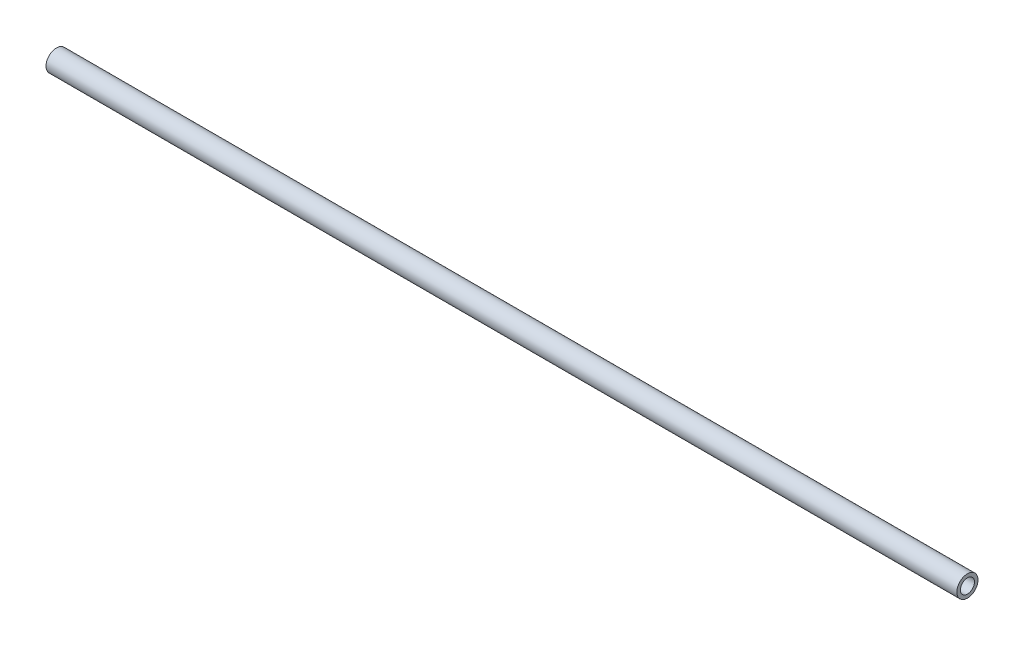
ISO-10303-21;
HEADER;
FILE_DESCRIPTION(('STEP AP214'),'2;1');
FILE_NAME('part.step','',(''),(''),'','','');
FILE_SCHEMA(('AUTOMOTIVE_DESIGN { 1 0 10303 214 1 1 1 1 }'));
ENDSEC;
DATA;
#1=APPLICATION_CONTEXT('core data for automotive mechanical design processes');
#2=APPLICATION_PROTOCOL_DEFINITION('international standard','automotive_design',2000,#1);
#3=PRODUCT_CONTEXT('',#1,'mechanical');
#4=PRODUCT('Part','Part','',(#3));
#5=PRODUCT_RELATED_PRODUCT_CATEGORY('part','',(#4));
#6=PRODUCT_DEFINITION_FORMATION('','',#4);
#7=PRODUCT_DEFINITION_CONTEXT('part definition',#1,'design');
#8=PRODUCT_DEFINITION('design','',#6,#7);
#9=PRODUCT_DEFINITION_SHAPE('','',#8);
#10=(LENGTH_UNIT() NAMED_UNIT(*) SI_UNIT(.MILLI.,.METRE.));
#11=(NAMED_UNIT(*) PLANE_ANGLE_UNIT() SI_UNIT($,.RADIAN.));
#12=(NAMED_UNIT(*) SI_UNIT($,.STERADIAN.) SOLID_ANGLE_UNIT());
#13=UNCERTAINTY_MEASURE_WITH_UNIT(LENGTH_MEASURE(1.E-05),#10,'distance_accuracy_value','');
#14=(GEOMETRIC_REPRESENTATION_CONTEXT(3) GLOBAL_UNCERTAINTY_ASSIGNED_CONTEXT((#13)) GLOBAL_UNIT_ASSIGNED_CONTEXT((#10,
#11,#12)) REPRESENTATION_CONTEXT('',''));
#15=CARTESIAN_POINT('',(0.,0.,0.));
#16=DIRECTION('',(0.,0.,1.));
#17=DIRECTION('',(1.,0.,0.));
#18=AXIS2_PLACEMENT_3D('',#15,#16,#17);
#19=CARTESIAN_POINT('',(205.232,0.,0.));
#20=DIRECTION('',(1.,0.,0.));
#21=DIRECTION('',(0.,0.,-1.));
#22=AXIS2_PLACEMENT_3D('',#19,#20,#21);
#23=PLANE('',#22);
#24=CARTESIAN_POINT('',(205.232,0.,0.));
#25=DIRECTION('',(1.,0.,0.));
#26=DIRECTION('',(0.,0.,-1.));
#27=AXIS2_PLACEMENT_3D('',#24,#25,#26);
#28=CIRCLE('',#27,4.7625);
#29=CARTESIAN_POINT('',(205.232,0.,-4.76250000000006));
#30=VERTEX_POINT('',#29);
#31=EDGE_CURVE('E12',#30,#30,#28,.T.);
#32=ORIENTED_EDGE('',*,*,#31,.T.);
#33=EDGE_LOOP('',(#32));
#34=FACE_BOUND('',#33,.T.);
#35=CARTESIAN_POINT('',(205.232,0.,0.));
#36=DIRECTION('',(1.,0.,0.));
#37=DIRECTION('',(0.,0.,-1.));
#38=AXIS2_PLACEMENT_3D('',#35,#36,#37);
#39=CIRCLE('',#38,3.175);
#40=CARTESIAN_POINT('',(205.232,0.,-3.17500000000006));
#41=VERTEX_POINT('',#40);
#42=EDGE_CURVE('E52',#41,#41,#39,.T.);
#43=ORIENTED_EDGE('',*,*,#42,.F.);
#44=EDGE_LOOP('',(#43));
#45=FACE_BOUND('',#44,.T.);
#46=ADVANCED_FACE('F41',(#34,#45),#23,.T.);
#47=CARTESIAN_POINT('',(-205.232,0.,0.));
#48=DIRECTION('',(1.,0.,0.));
#49=DIRECTION('',(0.,0.,-1.));
#50=AXIS2_PLACEMENT_3D('',#47,#48,#49);
#51=PLANE('',#50);
#52=CARTESIAN_POINT('',(-205.232,0.,0.));
#53=DIRECTION('',(1.,0.,0.));
#54=DIRECTION('',(0.,0.,-1.));
#55=AXIS2_PLACEMENT_3D('',#52,#53,#54);
#56=CIRCLE('',#55,4.7625);
#57=CARTESIAN_POINT('',(-205.232,0.,-4.76250000000001));
#58=VERTEX_POINT('',#57);
#59=EDGE_CURVE('E45',#58,#58,#56,.T.);
#60=ORIENTED_EDGE('',*,*,#59,.F.);
#61=EDGE_LOOP('',(#60));
#62=FACE_BOUND('',#61,.T.);
#63=CARTESIAN_POINT('',(-205.232,0.,0.));
#64=DIRECTION('',(1.,0.,0.));
#65=DIRECTION('',(0.,0.,-1.));
#66=AXIS2_PLACEMENT_3D('',#63,#64,#65);
#67=CIRCLE('',#66,3.175);
#68=CARTESIAN_POINT('',(-205.232,0.,-3.175));
#69=VERTEX_POINT('',#68);
#70=EDGE_CURVE('E54',#69,#69,#67,.T.);
#71=ORIENTED_EDGE('',*,*,#70,.T.);
#72=EDGE_LOOP('',(#71));
#73=FACE_BOUND('',#72,.T.);
#74=ADVANCED_FACE('F64',(#62,#73),#51,.F.);
#75=CARTESIAN_POINT('',(205.232,0.,0.));
#76=DIRECTION('',(-1.,0.,0.));
#77=DIRECTION('',(0.,0.,1.));
#78=AXIS2_PLACEMENT_3D('',#75,#76,#77);
#79=CYLINDRICAL_SURFACE('',#78,4.7625);
#80=ORIENTED_EDGE('',*,*,#31,.F.);
#81=EDGE_LOOP('',(#80));
#82=FACE_BOUND('',#81,.T.);
#83=ORIENTED_EDGE('',*,*,#59,.T.);
#84=EDGE_LOOP('',(#83));
#85=FACE_BOUND('',#84,.T.);
#86=ADVANCED_FACE('F43',(#82,#85),#79,.T.);
#87=CARTESIAN_POINT('',(205.232,0.,0.));
#88=DIRECTION('',(-1.,0.,0.));
#89=DIRECTION('',(0.,0.,1.));
#90=AXIS2_PLACEMENT_3D('',#87,#88,#89);
#91=CYLINDRICAL_SURFACE('',#90,3.175);
#92=ORIENTED_EDGE('',*,*,#42,.T.);
#93=EDGE_LOOP('',(#92));
#94=FACE_BOUND('',#93,.T.);
#95=ORIENTED_EDGE('',*,*,#70,.F.);
#96=EDGE_LOOP('',(#95));
#97=FACE_BOUND('',#96,.T.);
#98=ADVANCED_FACE('F60',(#94,#97),#91,.F.);
#99=CLOSED_SHELL('',(#46,#74,#86,#98));
#100=MANIFOLD_SOLID_BREP('B2',#99);
#101=ADVANCED_BREP_SHAPE_REPRESENTATION('',(#18,#100),#14);
#102=SHAPE_DEFINITION_REPRESENTATION(#9,#101);
ENDSEC;
END-ISO-10303-21;
